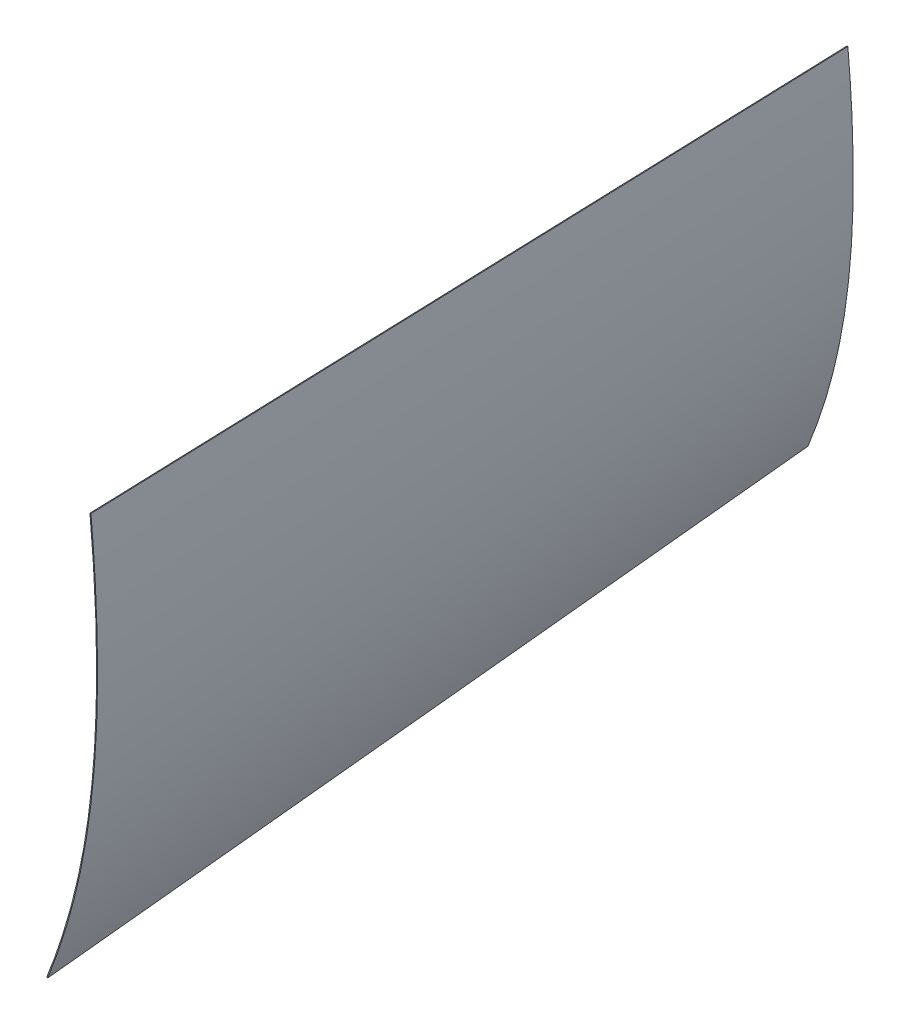
ISO-10303-21;
HEADER;
FILE_DESCRIPTION(('STEP AP214'),'2;1');
FILE_NAME('part.step','',(''),(''),'','','');
FILE_SCHEMA(('AUTOMOTIVE_DESIGN { 1 0 10303 214 1 1 1 1 }'));
ENDSEC;
DATA;
#1=APPLICATION_CONTEXT('core data for automotive mechanical design processes');
#2=APPLICATION_PROTOCOL_DEFINITION('international standard','automotive_design',2000,#1);
#3=PRODUCT_CONTEXT('',#1,'mechanical');
#4=PRODUCT('Part','Part','',(#3));
#5=PRODUCT_RELATED_PRODUCT_CATEGORY('part','',(#4));
#6=PRODUCT_DEFINITION_FORMATION('','',#4);
#7=PRODUCT_DEFINITION_CONTEXT('part definition',#1,'design');
#8=PRODUCT_DEFINITION('design','',#6,#7);
#9=PRODUCT_DEFINITION_SHAPE('','',#8);
#10=(LENGTH_UNIT() NAMED_UNIT(*) SI_UNIT(.MILLI.,.METRE.));
#11=(NAMED_UNIT(*) PLANE_ANGLE_UNIT() SI_UNIT($,.RADIAN.));
#12=(NAMED_UNIT(*) SI_UNIT($,.STERADIAN.) SOLID_ANGLE_UNIT());
#13=UNCERTAINTY_MEASURE_WITH_UNIT(LENGTH_MEASURE(1.E-05),#10,'distance_accuracy_value','');
#14=(GEOMETRIC_REPRESENTATION_CONTEXT(3) GLOBAL_UNCERTAINTY_ASSIGNED_CONTEXT((#13)) GLOBAL_UNIT_ASSIGNED_CONTEXT((#10,
#11,#12)) REPRESENTATION_CONTEXT('',''));
#15=CARTESIAN_POINT('',(0.,0.,0.));
#16=DIRECTION('',(0.,0.,1.));
#17=DIRECTION('',(1.,0.,0.));
#18=AXIS2_PLACEMENT_3D('',#15,#16,#17);
#19=CARTESIAN_POINT('',(466.611140213925,-2996.06608357652,-1237.06601958068));
#20=DIRECTION('',(0.0340355254360612,0.,0.999420623665677));
#21=DIRECTION('',(0.999420623665677,0.,-0.0340355254360612));
#22=AXIS2_PLACEMENT_3D('',#19,#20,#21);
#23=PLANE('',#22);
#24=CARTESIAN_POINT('',(464.7329691474,-2683.51000000006,-1237.00205798373));
#25=CARTESIAN_POINT('',(470.849624888753,-2750.93837704815,-1237.21036226237));
#26=CARTESIAN_POINT('',(474.470158610323,-2827.19923017659,-1237.33366046601));
#27=CARTESIAN_POINT('',(468.701212329022,-3041.49687790168,-1237.13719752213));
#28=CARTESIAN_POINT('',(445.733833689295,-3153.75817323704,-1236.35503755726));
#29=CARTESIAN_POINT('',(403.930987282872,-3259.1200239438,-1234.9314309111));
#30=B_SPLINE_CURVE_WITH_KNOTS('',3,(#24,#25,#26,#27,#28,#29),.UNSPECIFIED.,.F.,.F.,(4,2,4),
(-56.739502562534,-40.2608751649169,-9.08244148966291),.UNSPECIFIED.);
#31=CARTESIAN_POINT('',(464.7329691474,-2683.51000000006,-1237.00205798373));
#32=VERTEX_POINT('',#31);
#33=CARTESIAN_POINT('',(403.930987282872,-3259.1200239438,-1234.9314309111));
#34=VERTEX_POINT('',#33);
#35=EDGE_CURVE('E147',#32,#34,#30,.T.);
#36=ORIENTED_EDGE('',*,*,#35,.F.);
#37=DIRECTION('',(-0.995329044090019,-0.0903943725547161,0.0338961856451289));
#38=VECTOR('',#37,1.);
#39=CARTESIAN_POINT('',(466.249850610594,-2683.37223897629,-1237.05371577066));
#40=LINE('',#39,#38);
#41=CARTESIAN_POINT('',(466.249850610594,-2683.37223897629,-1237.05371577066));
#42=VERTEX_POINT('',#41);
#43=EDGE_CURVE('E13',#42,#32,#40,.T.);
#44=ORIENTED_EDGE('',*,*,#43,.F.);
#45=CARTESIAN_POINT('',(405.346632913427,-3259.68233989391,-1234.9796410858));
#46=CARTESIAN_POINT('',(409.347475200141,-3249.59842973105,-1235.11589079507));
#47=CARTESIAN_POINT('',(417.001753177927,-3229.31217603775,-1235.37655919298));
#48=CARTESIAN_POINT('',(430.934378250988,-3188.07769701693,-1235.85103831002));
#49=CARTESIAN_POINT('',(445.756996623566,-3135.03979825283,-1236.35582637693));
#50=CARTESIAN_POINT('',(459.380692330339,-3068.11953927663,-1236.81978482523));
#51=CARTESIAN_POINT('',(467.251493917822,-3008.90219119633,-1237.08782699015));
#52=CARTESIAN_POINT('',(471.451298297448,-2959.00502041134,-1237.23085240448));
#53=CARTESIAN_POINT('',(473.552843033924,-2920.24749419559,-1237.30242104899));
#54=CARTESIAN_POINT('',(474.597234533578,-2879.89590932481,-1237.33798806913));
#55=CARTESIAN_POINT('',(474.584547279796,-2839.41721128648,-1237.33755600146));
#56=CARTESIAN_POINT('',(473.643484070645,-2799.09279437812,-1237.30550785272));
#57=CARTESIAN_POINT('',(472.173825744251,-2765.96523019636,-1237.25545826183));
#58=CARTESIAN_POINT('',(470.642951911304,-2739.94017213857,-1237.20332396117));
#59=CARTESIAN_POINT('',(469.33067590633,-2720.70635667756,-1237.15863406555));
#60=CARTESIAN_POINT('',(468.112754832064,-2704.96556617701,-1237.11715745128));
#61=CARTESIAN_POINT('',(467.068754703944,-2692.54817563492,-1237.0816037594));
#62=CARTESIAN_POINT('',(466.528004546573,-2686.43853357675,-1237.06318837422));
#63=CARTESIAN_POINT('',(466.249850610594,-2683.37223897629,-1237.05371577066));
#64=B_SPLINE_CURVE_WITH_KNOTS('',3,(#45,#46,#47,#48,#49,#50,#51,#52,#53,#54,#55,#56,#57,#58,#59,
#60,#61,#62,#63),.UNSPECIFIED.,.F.,.F.,(4,1,1,1,1,1,1,1,1,1,1,1,1,1,1,1,4),(-56.7395025625342,
-53.7609362454794,-50.7823699284246,-44.8252372943149,-38.8681046602053,-32.9109720260957,
-29.9324057090409,-26.9538393919861,-23.9752730749313,-20.9967067578765,-18.0181404408217,
-15.0395741237669,-13.5502909652395,-12.0610078067121,-10.5717246481847,-9.82708306892099,
-9.08244148965729),.UNSPECIFIED.);
#65=CARTESIAN_POINT('',(405.346632913427,-3259.68233989391,-1234.9796410858));
#66=VERTEX_POINT('',#65);
#67=EDGE_CURVE('E106',#66,#42,#64,.T.);
#68=ORIENTED_EDGE('',*,*,#67,.F.);
#69=DIRECTION('',(0.928901332384992,-0.368973720543716,-0.031633972901222));
#70=VECTOR('',#69,1.);
#71=CARTESIAN_POINT('',(403.930987282872,-3259.1200239438,-1234.9314309111));
#72=LINE('',#71,#70);
#73=EDGE_CURVE('E114',#34,#66,#72,.T.);
#74=ORIENTED_EDGE('',*,*,#73,.F.);
#75=EDGE_LOOP('',(#36,#44,#68,#74));
#76=FACE_BOUND('',#75,.T.);
#77=ADVANCED_FACE('F96',(#76),#23,.F.);
#78=CARTESIAN_POINT('',(509.744180299187,-3046.03454501667,0.));
#79=DIRECTION('',(0.,0.,-1.));
#80=DIRECTION('',(-1.,0.,0.));
#81=AXIS2_PLACEMENT_3D('',#78,#79,#80);
#82=PLANE('',#81);
#83=CARTESIAN_POINT('',(505.97849639557,-2683.51000038057,0.));
#84=CARTESIAN_POINT('',(513.58770421844,-2763.3905144055,0.));
#85=CARTESIAN_POINT('',(518.261157834598,-2855.4071102022,0.));
#86=CARTESIAN_POINT('',(511.441151076744,-3104.43711127009,0.));
#87=CARTESIAN_POINT('',(485.301285557305,-3232.27565881846,0.));
#88=CARTESIAN_POINT('',(437.778449062825,-3352.30949965526,0.));
#89=B_SPLINE_CURVE_WITH_KNOTS('',3,(#83,#84,#85,#86,#87,#88),.UNSPECIFIED.,.F.,.F.,(4,2,4),
(-64.5398702067748,-44.6981270581919,-9.17980984821859),.UNSPECIFIED.);
#90=CARTESIAN_POINT('',(505.978496547569,-2683.51000036606,0.));
#91=VERTEX_POINT('',#90);
#92=CARTESIAN_POINT('',(437.778449062824,-3352.30949965526,0.));
#93=VERTEX_POINT('',#92);
#94=EDGE_CURVE('E144',#91,#93,#89,.T.);
#95=ORIENTED_EDGE('',*,*,#94,.T.);
#96=DIRECTION('',(0.929781584407413,-0.368111675034685,0.));
#97=VECTOR('',#96,1.);
#98=CARTESIAN_POINT('',(437.778449062824,-3352.30949965526,0.));
#99=LINE('',#98,#97);
#100=CARTESIAN_POINT('',(439.195436197461,-3352.87050184802,0.));
#101=VERTEX_POINT('',#100);
#102=EDGE_CURVE('E151',#93,#101,#99,.T.);
#103=ORIENTED_EDGE('',*,*,#102,.T.);
#104=CARTESIAN_POINT('',(439.195436197461,-3352.87050184802,0.));
#105=CARTESIAN_POINT('',(443.832479069598,-3341.15819452116,0.));
#106=CARTESIAN_POINT('',(452.69629078634,-3317.59503413952,0.));
#107=CARTESIAN_POINT('',(468.800365674251,-3269.68402015541,0.));
#108=CARTESIAN_POINT('',(485.870395110676,-3208.01533065638,0.));
#109=CARTESIAN_POINT('',(498.847288629547,-3143.08023434581,0.));
#110=CARTESIAN_POINT('',(506.764061227774,-3088.63978584835,0.));
#111=CARTESIAN_POINT('',(511.467361490751,-3046.43225188581,0.));
#112=CARTESIAN_POINT('',(514.934520054015,-3002.7039939759,0.));
#113=CARTESIAN_POINT('',(516.791881320256,-2964.9170030929,0.));
#114=CARTESIAN_POINT('',(517.658247256269,-2933.74130987213,0.));
#115=CARTESIAN_POINT('',(518.098594210434,-2902.4536117098,0.));
#116=CARTESIAN_POINT('',(517.898894644065,-2863.24377974606,0.));
#117=CARTESIAN_POINT('',(516.80831839843,-2824.30442301188,0.));
#118=CARTESIAN_POINT('',(515.468266720115,-2793.5500406739,0.));
#119=CARTESIAN_POINT('',(514.246025356614,-2770.74222584422,0.));
#120=CARTESIAN_POINT('',(512.82324316337,-2748.25150787216,0.));
#121=CARTESIAN_POINT('',(511.484321184933,-2729.82264190135,0.));
#122=CARTESIAN_POINT('',(510.329573500648,-2715.29751909885,0.));
#123=CARTESIAN_POINT('',(509.423699764513,-2704.51914527117,0.));
#124=CARTESIAN_POINT('',(508.637654296489,-2695.64264307893,0.));
#125=CARTESIAN_POINT('',(507.990503430791,-2688.60146012953,0.));
#126=CARTESIAN_POINT('',(507.662124100124,-2685.11332990081,0.));
#127=CARTESIAN_POINT('',(507.495628735318,-2683.36548234123,0.));
#128=B_SPLINE_CURVE_WITH_KNOTS('',3,(#104,#105,#106,#107,#108,#109,#110,#111,#112,#113,#114,
#115,#116,#117,#118,#119,#120,#121,#122,#123,#124,#125,#126,#127),.UNSPECIFIED.,.F.,.F.,(4,1,1,
1,1,1,1,1,1,1,1,1,1,1,1,1,1,1,1,1,1,4),(-64.5398702067748,-61.079866434365,-57.6198626619553,
-50.6998551171357,-43.7798475723162,-40.3198437999065,-36.8598400274967,-33.3998362550869,
-29.9398324826772,-28.2098305964723,-26.4798287102674,-23.0198249378576,-19.5598211654479,
-17.829819279243,-16.0998173930381,-14.3698155068332,-12.6398136206284,-11.7748126775259,
-10.9098117344235,-10.044810791321,-9.61231031976981,-9.17980984821859),.UNSPECIFIED.);
#129=CARTESIAN_POINT('',(507.495628735318,-2683.36548234123,0.));
#130=VERTEX_POINT('',#129);
#131=EDGE_CURVE('E161',#101,#130,#128,.T.);
#132=ORIENTED_EDGE('',*,*,#131,.T.);
#133=DIRECTION('',(-0.995493661252972,-0.0948281097837218,0.));
#134=VECTOR('',#133,1.);
#135=CARTESIAN_POINT('',(505.978496547569,-2683.51000036606,0.));
#136=LINE('',#135,#134);
#137=EDGE_CURVE('E167',#130,#91,#136,.T.);
#138=ORIENTED_EDGE('',*,*,#137,.T.);
#139=EDGE_LOOP('',(#95,#103,#132,#138));
#140=FACE_BOUND('',#139,.T.);
#141=ADVANCED_FACE('F165',(#140),#82,.F.);
#142=CARTESIAN_POINT('',(507.495628735318,-2683.36548234123,0.));
#143=CARTESIAN_POINT('',(493.74817096134,-2683.36773220243,-412.351269903524));
#144=CARTESIAN_POINT('',(479.999717567642,-2683.36998412596,-824.702512339441));
#145=CARTESIAN_POINT('',(466.249850610594,-2683.37223897629,-1237.05371577066));
#146=CARTESIAN_POINT('',(508.827591653767,-2697.34826281782,0.));
#147=CARTESIAN_POINT('',(495.007018154946,-2696.77797865411,-412.363900041611));
#148=CARTESIAN_POINT('',(481.185449036403,-2696.20769655273,-824.727772615616));
#149=CARTESIAN_POINT('',(467.362466354511,-2695.63741737815,-1237.09160618492));
#150=CARTESIAN_POINT('',(511.297267721723,-2725.88576392452,0.));
#151=CARTESIAN_POINT('',(497.333199368465,-2724.08798627555,-412.38704843802));
#152=CARTESIAN_POINT('',(483.368135395486,-2722.29021068891,-824.774069408433));
#153=CARTESIAN_POINT('',(469.401657859157,-2720.49243802907,-1237.16105137414));
#154=CARTESIAN_POINT('',(514.347821009394,-2770.60338907823,0.));
#155=CARTESIAN_POINT('',(500.19364227943,-2766.85665684213,-412.41520330506));
#156=CARTESIAN_POINT('',(486.038467929744,-2763.10992666836,-824.830379142513));
#157=CARTESIAN_POINT('',(471.881880016709,-2759.36319942138,-1237.24551597526));
#158=CARTESIAN_POINT('',(516.589150687991,-2816.49991917411,0.));
#159=CARTESIAN_POINT('',(502.27476693136,-2810.69315666581,-412.43519050067));
#160=CARTESIAN_POINT('',(487.959387555007,-2804.88639621985,-824.870353533734));
#161=CARTESIAN_POINT('',(473.642594615305,-2799.07963870068,-1237.3054775621));
#162=CARTESIAN_POINT('',(517.681485866151,-2855.46939040776,0.));
#163=CARTESIAN_POINT('',(503.264701743123,-2847.88010964437,-412.444103148086));
#164=CARTESIAN_POINT('',(488.846922000373,-2840.29083094331,-824.888178828565));
#165=CARTESIAN_POINT('',(474.427728694273,-2832.70155516905,-1237.33221550434));
#166=CARTESIAN_POINT('',(518.018298637372,-2886.76577098574,0.));
#167=CARTESIAN_POINT('',(503.543729146635,-2877.72950532307,-412.445958667658));
#168=CARTESIAN_POINT('',(489.068164036177,-2868.69324172274,-824.891889867709));
#169=CARTESIAN_POINT('',(474.591185362369,-2859.6569810492,-1237.33778206306));
#170=CARTESIAN_POINT('',(517.988957992467,-2910.27358916557,0.));
#171=CARTESIAN_POINT('',(503.482197724599,-2900.14121363483,-412.444529334767));
#172=CARTESIAN_POINT('',(488.974441837009,-2890.00884016642,-824.889031201927));
#173=CARTESIAN_POINT('',(474.46527238607,-2879.87646962482,-1237.33349406439));
#174=CARTESIAN_POINT('',(517.657623604745,-2933.74976048812,0.));
#175=CARTESIAN_POINT('',(503.131108588284,-2922.52412136783,-412.440095355916));
#176=CARTESIAN_POINT('',(488.603597952102,-2911.29848430988,-824.880163244226));
#177=CARTESIAN_POINT('',(474.07467375257,-2900.07285017872,-1237.32019212783));
#178=CARTESIAN_POINT('',(516.793178602334,-2964.89422368208,0.));
#179=CARTESIAN_POINT('',(502.26392921947,-2952.16710469531,-412.430189271012));
#180=CARTESIAN_POINT('',(487.733684216884,-2939.43998777088,-824.860351074418));
#181=CARTESIAN_POINT('',(473.202025650948,-2926.71287377324,-1237.29047387312));
#182=CARTESIAN_POINT('',(514.933315609084,-3002.72047246472,0.));
#183=CARTESIAN_POINT('',(500.441176158102,-2988.14326563621,-412.410340355645));
#184=CARTESIAN_POINT('',(485.948041087398,-2973.56606087004,-824.820653243683));
#185=CARTESIAN_POINT('',(471.453492453345,-2958.98885903066,-1237.23092712702));
#186=CARTESIAN_POINT('',(511.468177495917,-3046.42344218057,0.));
#187=CARTESIAN_POINT('',(497.079274007741,-3029.766573023,-412.374520694024));
#188=CARTESIAN_POINT('',(482.689374899843,-3013.10970592777,-824.749013920441));
#189=CARTESIAN_POINT('',(468.298062228597,-2996.45284175933,-1237.12346814216));
#190=CARTESIAN_POINT('',(506.76352305225,-3088.64448572412,0.));
#191=CARTESIAN_POINT('',(492.544128997268,-3069.96328718899,-412.326887310331));
#192=CARTESIAN_POINT('',(478.323739322565,-3051.2820907162,-824.653747153055));
#193=CARTESIAN_POINT('',(464.101936084512,-3032.60089717021,-1236.98056799108));
#194=CARTESIAN_POINT('',(500.82682652727,-3129.46761923665,0.));
#195=CARTESIAN_POINT('',(486.839247569251,-3108.84135479105,-412.267389925722));
#196=CARTESIAN_POINT('',(472.85067299151,-3088.21509240778,-824.534752383837));
#197=CARTESIAN_POINT('',(458.86068485042,-3067.58883295131,-1236.80207583725));
#198=CARTESIAN_POINT('',(493.656315855566,-3169.05560382332,0.));
#199=CARTESIAN_POINT('',(479.961971956524,-3146.56121912861,-412.195978261351));
#200=CARTESIAN_POINT('',(466.26663243776,-3124.06683649625,-824.391929055095));
#201=CARTESIAN_POINT('',(452.569879355647,-3101.57245679068,-1236.58784084414));
#202=CARTESIAN_POINT('',(485.256556497086,-3207.52466246282,0.));
#203=CARTESIAN_POINT('',(471.917243833806,-3183.22873471464,-412.112716955276));
#204=CARTESIAN_POINT('',(458.576935550804,-3158.93280902881,-824.225406442946));
#205=CARTESIAN_POINT('',(445.235213704454,-3134.63688626977,-1236.33805692591));
#206=CARTESIAN_POINT('',(475.628298133442,-3245.0169207818,0.));
#207=CARTESIAN_POINT('',(462.707461023592,-3218.96702449407,-412.017670645556));
#208=CARTESIAN_POINT('',(449.78562829402,-3192.91713026868,-824.035313823506));
#209=CARTESIAN_POINT('',(436.862382001098,-3166.86723897008,-1236.05291799675));
#210=CARTESIAN_POINT('',(464.774394207468,-3281.66157133293,0.));
#211=CARTESIAN_POINT('',(452.334662029033,-3253.90224299883,-411.910843970788));
#212=CARTESIAN_POINT('',(439.893934230876,-3226.14291672707,-823.821660473969));
#213=CARTESIAN_POINT('',(427.45179286937,-3198.38359338211,-1235.73243797245));
#214=CARTESIAN_POINT('',(452.696262773257,-3317.59514553224,0.));
#215=CARTESIAN_POINT('',(440.799928427455,-3288.16543733646,-411.792241569568));
#216=CARTESIAN_POINT('',(428.90259846193,-3258.73573120303,-823.58445567153));
#217=CARTESIAN_POINT('',(417.003854933057,-3229.30602799639,-1235.37663076879));
#218=CARTESIAN_POINT('',(443.832479069598,-3341.15819452116,0.));
#219=CARTESIAN_POINT('',(432.338612714043,-3310.63827057396,-411.705328244996));
#220=CARTESIAN_POINT('',(420.843750738767,-3280.11834868911,-823.410629022385));
#221=CARTESIAN_POINT('',(409.347475200141,-3249.59842973105,-1235.11589079507));
#222=CARTESIAN_POINT('',(439.195436197461,-3352.87050184802,0.));
#223=CARTESIAN_POINT('',(427.913636703714,-3321.80777884616,-411.659911675238));
#224=CARTESIAN_POINT('',(416.630841590245,-3290.74505790663,-823.31979588287));
#225=CARTESIAN_POINT('',(405.346632913427,-3259.68233989391,-1234.9796410858));
#226=B_SPLINE_SURFACE_WITH_KNOTS('',3,3,((#142,#143,#144,#145),(#146,#147,#148,#149),(#150,#151,
#152,#153),(#154,#155,#156,#157),(#158,#159,#160,#161),(#162,#163,#164,#165),(#166,#167,#168,
#169),(#170,#171,#172,#173),(#174,#175,#176,#177),(#178,#179,#180,#181),(#182,#183,#184,#185),
(#186,#187,#188,#189),(#190,#191,#192,#193),(#194,#195,#196,#197),(#198,#199,#200,#201),(#202,
#203,#204,#205),(#206,#207,#208,#209),(#210,#211,#212,#213),(#214,#215,#216,#217),(#218,#219,
#220,#221),(#222,#223,#224,#225)),.UNSPECIFIED.,.F.,.F.,.F.,(4,1,1,1,1,1,1,1,1,1,1,1,1,1,1,1,1,
1,4),(4,4),(0.500925383849193,0.532117547358619,0.563309710868044,0.594501874377469,
0.625694037886895,0.641290119641608,0.65688620139632,0.672482283151033,0.688078364905746,
0.719270528415171,0.750462691924597,0.781654855434022,0.812847018943448,0.844039182452873,
0.875231345962298,0.906423509471724,0.937615672981149,0.968807836490575,1.),(0.,1.),.UNSPECIFIED.);
#227=CARTESIAN_POINT('',(439.195436197461,-3352.87050184802,0.));
#228=CARTESIAN_POINT('',(427.913636703714,-3321.80777884616,-411.659911675238));
#229=CARTESIAN_POINT('',(416.630841590245,-3290.74505790663,-823.31979588287));
#230=CARTESIAN_POINT('',(405.346632913427,-3259.68233989391,-1234.9796410858));
#231=B_SPLINE_CURVE_WITH_KNOTS('',3,(#227,#228,#229,#230),.UNSPECIFIED.,.F.,.F.,(4,4),(0.,1.),.UNSPECIFIED.);
#232=EDGE_CURVE('E157',#101,#66,#231,.T.);
#233=CARTESIAN_POINT('',(507.495628735318,-2683.36548234123,0.));
#234=CARTESIAN_POINT('',(493.74817096134,-2683.36773220243,-412.351269903524));
#235=CARTESIAN_POINT('',(479.999717567642,-2683.36998412596,-824.702512339441));
#236=CARTESIAN_POINT('',(466.249850610594,-2683.37223897629,-1237.05371577066));
#237=B_SPLINE_CURVE_WITH_KNOTS('',3,(#233,#234,#235,#236),.UNSPECIFIED.,.F.,.F.,(4,4),(0.,1.),.UNSPECIFIED.);
#238=EDGE_CURVE('E263',#130,#42,#237,.T.);
#239=ORIENTED_EDGE('',*,*,#131,.F.);
#240=ORIENTED_EDGE('',*,*,#232,.T.);
#241=ORIENTED_EDGE('',*,*,#67,.T.);
#242=ORIENTED_EDGE('',*,*,#238,.F.);
#243=EDGE_LOOP('',(#239,#240,#241,#242));
#244=FACE_BOUND('',#243,.T.);
#245=ADVANCED_FACE('F188',(#244),#226,.T.);
#246=CARTESIAN_POINT('',(505.978496547569,-2683.51000036606,0.));
#247=CARTESIAN_POINT('',(492.231122348444,-2683.50999789357,-412.334050641216));
#248=CARTESIAN_POINT('',(478.482752529597,-2683.50999748342,-824.668073814826));
#249=CARTESIAN_POINT('',(464.7329691474,-2683.51000000006,-1237.00205798373));
#250=CARTESIAN_POINT('',(506.104924229881,-2683.49795719733,0.));
#251=CARTESIAN_POINT('',(492.357543066185,-2683.49814241931,-412.335485579742));
#252=CARTESIAN_POINT('',(478.609166282767,-2683.49832970363,-824.670943691877));
#253=CARTESIAN_POINT('',(464.859375936,-2683.49851991474,-1237.00636279931));
#254=CARTESIAN_POINT('',(506.357779594505,-2683.47387085985,0.));
#255=CARTESIAN_POINT('',(492.610384501667,-2683.47443147078,-412.338355456792));
#256=CARTESIAN_POINT('',(478.861993789108,-2683.47499414405,-824.676683445978));
#257=CARTESIAN_POINT('',(465.112189513198,-2683.47555974411,-1237.01497243046));
#258=CARTESIAN_POINT('',(506.737062641444,-2683.43774135365,0.));
#259=CARTESIAN_POINT('',(492.989646654893,-2683.438865048,-412.34266027237));
#260=CARTESIAN_POINT('',(479.24123504862,-2683.43999080469,-824.685293077134));
#261=CARTESIAN_POINT('',(465.491409878997,-2683.44111948817,-1237.0278868772));
#262=CARTESIAN_POINT('',(507.11634568838,-2683.40161184744,0.));
#263=CARTESIAN_POINT('',(493.368908808116,-2683.40329862521,-412.346965087947));
#264=CARTESIAN_POINT('',(479.62047630813,-2683.40498746532,-824.693902708287));
#265=CARTESIAN_POINT('',(465.870630244795,-2683.40667923223,-1237.04080132393));
#266=CARTESIAN_POINT('',(507.369201053005,-2683.37752550997,0.));
#267=CARTESIAN_POINT('',(493.621750243599,-2683.37958767669,-412.349834964998));
#268=CARTESIAN_POINT('',(479.873303814471,-2683.38165190575,-824.69964246239));
#269=CARTESIAN_POINT('',(466.123443821994,-2683.3837190616,-1237.04941095508));
#270=CARTESIAN_POINT('',(507.495628735318,-2683.36548234123,0.));
#271=CARTESIAN_POINT('',(493.74817096134,-2683.36773220243,-412.351269903524));
#272=CARTESIAN_POINT('',(479.999717567642,-2683.36998412596,-824.702512339441));
#273=CARTESIAN_POINT('',(466.249850610594,-2683.37223897629,-1237.05371577066));
#274=B_SPLINE_SURFACE_WITH_KNOTS('',3,3,((#246,#247,#248,#249),(#250,#251,#252,#253),(#254,#255,
#256,#257),(#258,#259,#260,#261),(#262,#263,#264,#265),(#266,#267,#268,#269),(#270,#271,#272,
#273)),.UNSPECIFIED.,.F.,.F.,.F.,(4,1,1,1,4),(4,4),(0.499715707047186,0.500018126247688,
0.50032054544819,0.500622964648691,0.500925383849193),(0.,1.),.UNSPECIFIED.);
#275=CARTESIAN_POINT('',(505.978496547569,-2683.51000036606,0.));
#276=CARTESIAN_POINT('',(492.231122348444,-2683.50999789357,-412.334050641216));
#277=CARTESIAN_POINT('',(478.482752529597,-2683.50999748342,-824.668073814826));
#278=CARTESIAN_POINT('',(464.7329691474,-2683.51000000006,-1237.00205798373));
#279=B_SPLINE_CURVE_WITH_KNOTS('',3,(#275,#276,#277,#278),.UNSPECIFIED.,.F.,.F.,(4,4),(0.,1.),.UNSPECIFIED.);
#280=EDGE_CURVE('E150',#91,#32,#279,.T.);
#281=ORIENTED_EDGE('',*,*,#137,.F.);
#282=ORIENTED_EDGE('',*,*,#238,.T.);
#283=ORIENTED_EDGE('',*,*,#43,.T.);
#284=ORIENTED_EDGE('',*,*,#280,.F.);
#285=EDGE_LOOP('',(#281,#282,#283,#284));
#286=FACE_BOUND('',#285,.T.);
#287=ADVANCED_FACE('F242',(#286),#274,.T.);
#288=CARTESIAN_POINT('',(437.778449062825,-3352.30949965526,0.));
#289=CARTESIAN_POINT('',(426.497096737104,-3321.24633873428,-411.643841617005));
#290=CARTESIAN_POINT('',(415.214748791663,-3290.18317987564,-823.287655766402));
#291=CARTESIAN_POINT('',(403.930987282872,-3259.1200239438,-1234.9314309111));
#292=CARTESIAN_POINT('',(442.407868654256,-3340.61644731675,0.));
#293=CARTESIAN_POINT('',(430.914558904913,-3310.09579597903,-411.689175376115));
#294=CARTESIAN_POINT('',(419.420253535849,-3279.57514670366,-823.378323284623));
#295=CARTESIAN_POINT('',(407.924534603435,-3249.05450035508,-1235.06743218843));
#296=CARTESIAN_POINT('',(451.260852471162,-3317.08228911258,0.));
#297=CARTESIAN_POINT('',(439.364490230849,-3287.65340930451,-411.775946197729));
#298=CARTESIAN_POINT('',(427.467132370814,-3258.22453155878,-823.55186492785));
#299=CARTESIAN_POINT('',(415.56836094743,-3228.79565673985,-1235.32774465327));
#300=CARTESIAN_POINT('',(463.320814433286,-3281.20250610852,0.));
#301=CARTESIAN_POINT('',(450.881850512445,-3253.44191141048,-411.89436945677));
#302=CARTESIAN_POINT('',(438.441890971883,-3225.68131877478,-823.788711445933));
#303=CARTESIAN_POINT('',(426.000517867972,-3197.92072906588,-1235.68301443039));
#304=CARTESIAN_POINT('',(474.158883029026,-3244.61124241272,0.));
#305=CARTESIAN_POINT('',(461.238828449951,-3218.55944799233,-412.001016858871));
#306=CARTESIAN_POINT('',(448.317778251154,-3192.50765563428,-824.002006250136));
#307=CARTESIAN_POINT('',(435.395314489008,-3166.45586620303,-1236.0029566367));
#308=CARTESIAN_POINT('',(483.773391776168,-3207.17295567328,0.));
#309=CARTESIAN_POINT('',(470.434653963191,-3182.8752551573,-412.095900013741));
#310=CARTESIAN_POINT('',(457.094920530493,-3158.57755670365,-824.191772559876));
#311=CARTESIAN_POINT('',(443.753773534445,-3134.2798611768,-1236.28760610131));
#312=CARTESIAN_POINT('',(492.161480581856,-3168.7569829697,0.));
#313=CARTESIAN_POINT('',(478.467761231566,-3146.26182196687,-412.179030531088));
#314=CARTESIAN_POINT('',(464.773046261554,-3123.76666302639,-824.35803359457));
#315=CARTESIAN_POINT('',(451.076917728193,-3101.27150701269,-1236.53699765335));
#316=CARTESIAN_POINT('',(499.322256606243,-3129.22348923256,0.));
#317=CARTESIAN_POINT('',(485.335375828344,-3108.59557191817,-412.250334197692));
#318=CARTESIAN_POINT('',(471.347499430724,-3087.96765666612,-824.500640927778));
#319=CARTESIAN_POINT('',(457.358209469754,-3067.33974434086,-1236.75090865316));
#320=CARTESIAN_POINT('',(505.251639948149,-3088.44988983731,0.));
#321=CARTESIAN_POINT('',(491.03259861924,-3069.76442880486,-412.309736800332));
#322=CARTESIAN_POINT('',(476.81256167061,-3051.07896983476,-824.619446133057));
#323=CARTESIAN_POINT('',(462.591111158631,-3032.39351379144,-1236.92911646108));
#324=CARTESIAN_POINT('',(509.950602964876,-3046.28126623269,0.));
#325=CARTESIAN_POINT('',(495.563820288616,-3029.61258297922,-412.357365788975));
#326=CARTESIAN_POINT('',(481.176041992634,-3012.9439017881,-824.714704110344));
#327=CARTESIAN_POINT('',(466.786850133302,-2996.27522352377,-1237.07200342701));
#328=CARTESIAN_POINT('',(513.412320031551,-3002.6226056554,0.));
#329=CARTESIAN_POINT('',(498.919511394105,-2988.04855080943,-412.393051601614));
#330=CARTESIAN_POINT('',(484.425707136936,-2973.47449802579,-824.786075735622));
#331=CARTESIAN_POINT('',(469.930489316419,-2958.90044816895,-1237.17906086493));
#332=CARTESIAN_POINT('',(515.270073466372,-2964.83130265488,0.));
#333=CARTESIAN_POINT('',(500.741650205037,-2952.099943749,-412.412927492894));
#334=CARTESIAN_POINT('',(486.21223132398,-2939.36858690547,-824.825827518182));
#335=CARTESIAN_POINT('',(471.681398879574,-2926.63723298873,-1237.23868853877));
#336=CARTESIAN_POINT('',(516.134071222574,-2933.72135512702,0.));
#337=CARTESIAN_POINT('',(501.608172244269,-2922.49172976234,-412.422821346327));
#338=CARTESIAN_POINT('',(487.081277646243,-2911.26210646,-824.845615225047));
#339=CARTESIAN_POINT('',(472.552969484867,-2900.03248608445,-1237.26837009907));
#340=CARTESIAN_POINT('',(516.4647296569,-2910.26031191867,0.));
#341=CARTESIAN_POINT('',(501.958393222938,-2900.12784025339,-412.427241106358));
#342=CARTESIAN_POINT('',(487.451061169254,-2889.99537065044,-824.854454745109));
#343=CARTESIAN_POINT('',(472.942315552221,-2879.86290397429,-1237.28162937916));
#344=CARTESIAN_POINT('',(516.494601774156,-2886.77390422102,0.));
#345=CARTESIAN_POINT('',(502.020061573354,-2877.73538892362,-412.428663036095));
#346=CARTESIAN_POINT('',(487.544525752831,-2868.69687568856,-824.857298604583));
#347=CARTESIAN_POINT('',(473.067576368958,-2859.6583653803,-1237.28589516837));
#348=CARTESIAN_POINT('',(516.157362928302,-2855.49921203863,0.));
#349=CARTESIAN_POINT('',(501.740798255032,-2847.9064350272,-412.426809155771));
#350=CARTESIAN_POINT('',(487.32323796204,-2840.31366007812,-824.853590843935));
#351=CARTESIAN_POINT('',(472.904264105699,-2832.72088805582,-1237.2803335274));
#352=CARTESIAN_POINT('',(515.06685680271,-2816.56615964625,0.));
#353=CARTESIAN_POINT('',(500.752910080157,-2810.75863261801,-412.417924681196));
#354=CARTESIAN_POINT('',(486.437967737882,-2804.95110765211,-824.835821894786));
#355=CARTESIAN_POINT('',(472.121611832259,-2799.14358561301,-1237.25368010367));
#356=CARTESIAN_POINT('',(512.82508981026,-2770.67786420968,0.));
#357=CARTESIAN_POINT('',(498.67074525894,-2766.9263312128,-412.397911990911));
#358=CARTESIAN_POINT('',(484.515405087898,-2763.17480027826,-824.795796514216));
#359=CARTESIAN_POINT('',(470.358651353506,-2759.42327227052,-1237.19364203282));
#360=CARTESIAN_POINT('',(509.780459436334,-2726.03399237667,0.));
#361=CARTESIAN_POINT('',(495.81706637811,-2724.23940008257,-412.369853003753));
#362=CARTESIAN_POINT('',(481.852677700165,-2722.44480985081,-824.7396785399));
#363=CARTESIAN_POINT('',(467.88687545887,-2720.65022254584,-1237.10946507135));
#364=CARTESIAN_POINT('',(507.305390286648,-2697.43956684046,0.));
#365=CARTESIAN_POINT('',(493.484253415622,-2696.8590094799,-412.346601203288));
#366=CARTESIAN_POINT('',(479.662120924875,-2696.27845418169,-824.69317493897));
#367=CARTESIAN_POINT('',(465.838574870778,-2695.69790181026,-1237.03970966995));
#368=CARTESIAN_POINT('',(505.978496547569,-2683.51000036606,0.));
#369=CARTESIAN_POINT('',(492.231122348444,-2683.50999789357,-412.334050641216));
#370=CARTESIAN_POINT('',(478.482752529597,-2683.50999748342,-824.668073814826));
#371=CARTESIAN_POINT('',(464.7329691474,-2683.51000000006,-1237.00205798373));
#372=B_SPLINE_SURFACE_WITH_KNOTS('',3,3,((#288,#289,#290,#291),(#292,#293,#294,#295),(#296,#297,
#298,#299),(#300,#301,#302,#303),(#304,#305,#306,#307),(#308,#309,#310,#311),(#312,#313,#314,
#315),(#316,#317,#318,#319),(#320,#321,#322,#323),(#324,#325,#326,#327),(#328,#329,#330,#331),
(#332,#333,#334,#335),(#336,#337,#338,#339),(#340,#341,#342,#343),(#344,#345,#346,#347),(#348,
#349,#350,#351),(#352,#353,#354,#355),(#356,#357,#358,#359),(#360,#361,#362,#363),(#364,#365,
#366,#367),(#368,#369,#370,#371)),.UNSPECIFIED.,.F.,.F.,.F.,(4,1,1,1,1,1,1,1,1,1,1,1,1,1,1,1,1,
1,4),(4,4),(0.00120967685808938,0.0323663037449079,0.0635229306317265,0.094679557518545,
0.125836184405364,0.156992811292182,0.188149438179001,0.219306065065819,0.250462691952638,
0.281619318839456,0.312775945726275,0.328354259169684,0.343932572613093,0.359510886056503,
0.375089199499912,0.40624582638673,0.437402453273549,0.468559080160368,0.499715707047186),(0.,
1.),.UNSPECIFIED.);
#373=CARTESIAN_POINT('',(437.778449062825,-3352.30949965526,0.));
#374=CARTESIAN_POINT('',(426.497096737104,-3321.24633873428,-411.643841617005));
#375=CARTESIAN_POINT('',(415.214748791663,-3290.18317987564,-823.287655766402));
#376=CARTESIAN_POINT('',(403.930987282872,-3259.1200239438,-1234.9314309111));
#377=B_SPLINE_CURVE_WITH_KNOTS('',3,(#373,#374,#375,#376),.UNSPECIFIED.,.F.,.F.,(4,4),(0.,1.),.UNSPECIFIED.);
#378=EDGE_CURVE('E140',#93,#34,#377,.T.);
#379=ORIENTED_EDGE('',*,*,#94,.F.);
#380=ORIENTED_EDGE('',*,*,#280,.T.);
#381=ORIENTED_EDGE('',*,*,#35,.T.);
#382=ORIENTED_EDGE('',*,*,#378,.F.);
#383=EDGE_LOOP('',(#379,#380,#381,#382));
#384=FACE_BOUND('',#383,.T.);
#385=ADVANCED_FACE('F142',(#384),#372,.T.);
#386=CARTESIAN_POINT('',(439.195436197461,-3352.87050184802,0.));
#387=CARTESIAN_POINT('',(427.913636703714,-3321.80777884616,-411.659911675238));
#388=CARTESIAN_POINT('',(416.630841590245,-3290.74505790663,-823.31979588287));
#389=CARTESIAN_POINT('',(405.346632913427,-3259.68233989391,-1234.9796410858));
#390=CARTESIAN_POINT('',(439.077353936241,-3352.82375166529,0.));
#391=CARTESIAN_POINT('',(427.795591706496,-3321.76099217017,-411.658572503719));
#392=CARTESIAN_POINT('',(416.51283385703,-3290.69823473738,-823.317117539831));
#393=CARTESIAN_POINT('',(405.228662444214,-3259.6354802314,-1234.97562357124));
#394=CARTESIAN_POINT('',(438.841189413803,-3352.73025129983,0.));
#395=CARTESIAN_POINT('',(427.559501712062,-3321.66741881819,-411.65589416068));
#396=CARTESIAN_POINT('',(416.2768183906,-3290.60458839889,-823.311760853754));
#397=CARTESIAN_POINT('',(404.992721505788,-3259.54176090638,-1234.96758854213));
#398=CARTESIAN_POINT('',(438.486942630142,-3352.59000075164,0.));
#399=CARTESIAN_POINT('',(427.205366720408,-3321.52705879022,-411.651876646121));
#400=CARTESIAN_POINT('',(415.922795190953,-3290.46411889114,-823.303725824635));
#401=CARTESIAN_POINT('',(404.638810098149,-3259.40118191885,-1234.95553599845));
#402=CARTESIAN_POINT('',(438.132695846484,-3352.44975020345,0.));
#403=CARTESIAN_POINT('',(426.851231728757,-3321.38669876225,-411.647859131563));
#404=CARTESIAN_POINT('',(415.568771991308,-3290.32364938339,-823.29569079552));
#405=CARTESIAN_POINT('',(404.284898690511,-3259.26060293133,-1234.94348345477));
#406=CARTESIAN_POINT('',(437.896531324044,-3352.35624983799,0.));
#407=CARTESIAN_POINT('',(426.615141734322,-3321.29312541027,-411.645180788524));
#408=CARTESIAN_POINT('',(415.332756524878,-3290.23000304489,-823.290334109441));
#409=CARTESIAN_POINT('',(404.048957752085,-3259.16688360631,-1234.93544842566));
#410=CARTESIAN_POINT('',(437.778449062825,-3352.30949965526,0.));
#411=CARTESIAN_POINT('',(426.497096737104,-3321.24633873428,-411.643841617005));
#412=CARTESIAN_POINT('',(415.214748791663,-3290.18317987564,-823.287655766402));
#413=CARTESIAN_POINT('',(403.930987282872,-3259.1200239438,-1234.9314309111));
#414=B_SPLINE_SURFACE_WITH_KNOTS('',3,3,((#386,#387,#388,#389),(#390,#391,#392,#393),(#394,#395,
#396,#397),(#398,#399,#400,#401),(#402,#403,#404,#405),(#406,#407,#408,#409),(#410,#411,#412,
#413)),.UNSPECIFIED.,.F.,.F.,.F.,(4,1,1,1,4),(4,4),(0.,0.000302419214522346,
0.000604838429044692,0.000907257643567038,0.00120967685808938),(0.,1.),.UNSPECIFIED.);
#415=ORIENTED_EDGE('',*,*,#102,.F.);
#416=ORIENTED_EDGE('',*,*,#378,.T.);
#417=ORIENTED_EDGE('',*,*,#73,.T.);
#418=ORIENTED_EDGE('',*,*,#232,.F.);
#419=EDGE_LOOP('',(#415,#416,#417,#418));
#420=FACE_BOUND('',#419,.T.);
#421=ADVANCED_FACE('F155',(#420),#414,.T.);
#422=CLOSED_SHELL('',(#77,#141,#245,#287,#385,#421));
#423=MANIFOLD_SOLID_BREP('B2',#422);
#424=ADVANCED_BREP_SHAPE_REPRESENTATION('',(#18,#423),#14);
#425=SHAPE_DEFINITION_REPRESENTATION(#9,#424);
ENDSEC;
END-ISO-10303-21;
